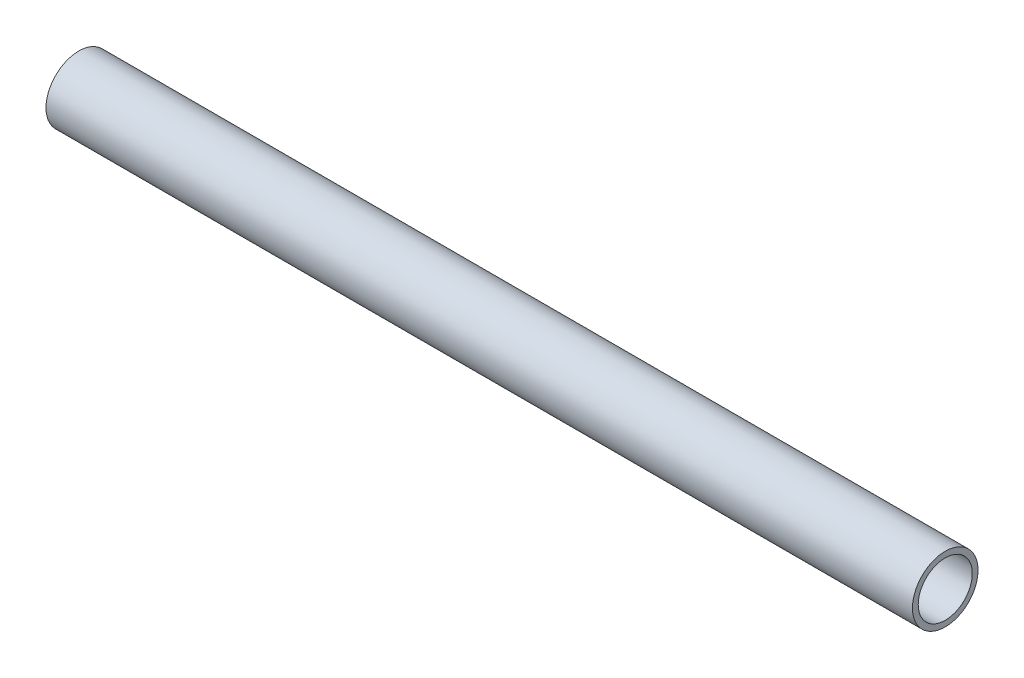
ISO-10303-21;
HEADER;
FILE_DESCRIPTION(('STEP AP214'),'2;1');
FILE_NAME('part.step','',(''),(''),'','','');
FILE_SCHEMA(('AUTOMOTIVE_DESIGN { 1 0 10303 214 1 1 1 1 }'));
ENDSEC;
DATA;
#1=APPLICATION_CONTEXT('core data for automotive mechanical design processes');
#2=APPLICATION_PROTOCOL_DEFINITION('international standard','automotive_design',2000,#1);
#3=PRODUCT_CONTEXT('',#1,'mechanical');
#4=PRODUCT('Part','Part','',(#3));
#5=PRODUCT_RELATED_PRODUCT_CATEGORY('part','',(#4));
#6=PRODUCT_DEFINITION_FORMATION('','',#4);
#7=PRODUCT_DEFINITION_CONTEXT('part definition',#1,'design');
#8=PRODUCT_DEFINITION('design','',#6,#7);
#9=PRODUCT_DEFINITION_SHAPE('','',#8);
#10=(LENGTH_UNIT() NAMED_UNIT(*) SI_UNIT(.MILLI.,.METRE.));
#11=(NAMED_UNIT(*) PLANE_ANGLE_UNIT() SI_UNIT($,.RADIAN.));
#12=(NAMED_UNIT(*) SI_UNIT($,.STERADIAN.) SOLID_ANGLE_UNIT());
#13=UNCERTAINTY_MEASURE_WITH_UNIT(LENGTH_MEASURE(1.E-05),#10,'distance_accuracy_value','');
#14=(GEOMETRIC_REPRESENTATION_CONTEXT(3) GLOBAL_UNCERTAINTY_ASSIGNED_CONTEXT((#13)) GLOBAL_UNIT_ASSIGNED_CONTEXT((#10,
#11,#12)) REPRESENTATION_CONTEXT('',''));
#15=CARTESIAN_POINT('',(0.,0.,0.));
#16=DIRECTION('',(0.,0.,1.));
#17=DIRECTION('',(1.,0.,0.));
#18=AXIS2_PLACEMENT_3D('',#15,#16,#17);
#19=CARTESIAN_POINT('',(-174.756994131163,684.280621263213,0.));
#20=DIRECTION('',(1.,0.,0.));
#21=DIRECTION('',(0.,0.,-1.));
#22=AXIS2_PLACEMENT_3D('',#19,#20,#21);
#23=CYLINDRICAL_SURFACE('',#22,2.61620000000002);
#24=CARTESIAN_POINT('',(-174.756994131163,684.280621263213,0.));
#25=DIRECTION('',(-1.,0.,0.));
#26=DIRECTION('',(0.,0.,1.));
#27=AXIS2_PLACEMENT_3D('',#24,#25,#26);
#28=CIRCLE('',#27,2.61620000000002);
#29=CARTESIAN_POINT('',(-174.756994131163,684.280621263213,2.61620000000002));
#30=VERTEX_POINT('',#29);
#31=EDGE_CURVE('E44',#30,#30,#28,.T.);
#32=ORIENTED_EDGE('',*,*,#31,.T.);
#33=EDGE_LOOP('',(#32));
#34=FACE_BOUND('',#33,.T.);
#35=CARTESIAN_POINT('',(-90.9007015950548,684.280621263213,0.));
#36=DIRECTION('',(-1.,0.,0.));
#37=DIRECTION('',(0.,0.,1.));
#38=AXIS2_PLACEMENT_3D('',#35,#36,#37);
#39=CIRCLE('',#38,2.61620000000002);
#40=CARTESIAN_POINT('',(-90.9007015950548,684.280621263213,2.61620000000002));
#41=VERTEX_POINT('',#40);
#42=EDGE_CURVE('E50',#41,#41,#39,.T.);
#43=ORIENTED_EDGE('',*,*,#42,.F.);
#44=EDGE_LOOP('',(#43));
#45=FACE_BOUND('',#44,.T.);
#46=ADVANCED_FACE('F37',(#34,#45),#23,.F.);
#47=CARTESIAN_POINT('',(-174.756994131163,684.280621263213,0.));
#48=DIRECTION('',(1.,0.,0.));
#49=DIRECTION('',(0.,0.,-1.));
#50=AXIS2_PLACEMENT_3D('',#47,#48,#49);
#51=CYLINDRICAL_SURFACE('',#50,3.17499999999997);
#52=CARTESIAN_POINT('',(-174.756994131163,684.280621263213,0.));
#53=DIRECTION('',(-1.,0.,0.));
#54=DIRECTION('',(0.,0.,1.));
#55=AXIS2_PLACEMENT_3D('',#52,#53,#54);
#56=CIRCLE('',#55,3.17499999999997);
#57=CARTESIAN_POINT('',(-174.756994131163,684.280621263213,3.17499999999997));
#58=VERTEX_POINT('',#57);
#59=EDGE_CURVE('E11',#58,#58,#56,.T.);
#60=ORIENTED_EDGE('',*,*,#59,.F.);
#61=EDGE_LOOP('',(#60));
#62=FACE_BOUND('',#61,.T.);
#63=CARTESIAN_POINT('',(-90.9007015950548,684.280621263213,0.));
#64=DIRECTION('',(-1.,0.,0.));
#65=DIRECTION('',(0.,0.,1.));
#66=AXIS2_PLACEMENT_3D('',#63,#64,#65);
#67=CIRCLE('',#66,3.17499999999997);
#68=CARTESIAN_POINT('',(-90.9007015950548,684.280621263213,3.17499999999997));
#69=VERTEX_POINT('',#68);
#70=EDGE_CURVE('E40',#69,#69,#67,.T.);
#71=ORIENTED_EDGE('',*,*,#70,.T.);
#72=EDGE_LOOP('',(#71));
#73=FACE_BOUND('',#72,.T.);
#74=ADVANCED_FACE('F57',(#62,#73),#51,.T.);
#75=CARTESIAN_POINT('',(-174.756994131163,684.280621263213,0.));
#76=DIRECTION('',(-1.,0.,0.));
#77=DIRECTION('',(0.,0.,1.));
#78=AXIS2_PLACEMENT_3D('',#75,#76,#77);
#79=PLANE('',#78);
#80=ORIENTED_EDGE('',*,*,#31,.F.);
#81=EDGE_LOOP('',(#80));
#82=FACE_BOUND('',#81,.T.);
#83=ORIENTED_EDGE('',*,*,#59,.T.);
#84=EDGE_LOOP('',(#83));
#85=FACE_BOUND('',#84,.T.);
#86=ADVANCED_FACE('F61',(#82,#85),#79,.T.);
#87=CARTESIAN_POINT('',(-90.9007015950548,684.280621263213,0.));
#88=DIRECTION('',(-1.,0.,0.));
#89=DIRECTION('',(0.,0.,1.));
#90=AXIS2_PLACEMENT_3D('',#87,#88,#89);
#91=PLANE('',#90);
#92=ORIENTED_EDGE('',*,*,#42,.T.);
#93=EDGE_LOOP('',(#92));
#94=FACE_BOUND('',#93,.T.);
#95=ORIENTED_EDGE('',*,*,#70,.F.);
#96=EDGE_LOOP('',(#95));
#97=FACE_BOUND('',#96,.T.);
#98=ADVANCED_FACE('F59',(#94,#97),#91,.F.);
#99=CLOSED_SHELL('',(#46,#74,#86,#98));
#100=MANIFOLD_SOLID_BREP('B2',#99);
#101=ADVANCED_BREP_SHAPE_REPRESENTATION('',(#18,#100),#14);
#102=SHAPE_DEFINITION_REPRESENTATION(#9,#101);
ENDSEC;
END-ISO-10303-21;
